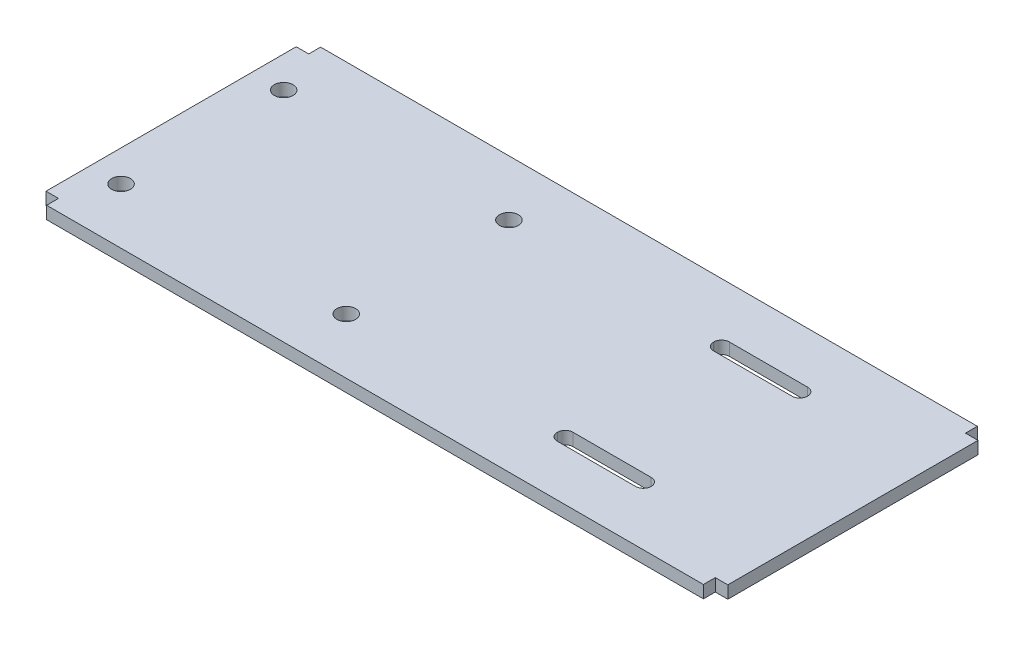
ISO-10303-21;
HEADER;
FILE_DESCRIPTION(('STEP AP214'),'2;1');
FILE_NAME('part.step','',(''),(''),'','','');
FILE_SCHEMA(('AUTOMOTIVE_DESIGN { 1 0 10303 214 1 1 1 1 }'));
ENDSEC;
DATA;
#1=APPLICATION_CONTEXT('core data for automotive mechanical design processes');
#2=APPLICATION_PROTOCOL_DEFINITION('international standard','automotive_design',2000,#1);
#3=PRODUCT_CONTEXT('',#1,'mechanical');
#4=PRODUCT('Part','Part','',(#3));
#5=PRODUCT_RELATED_PRODUCT_CATEGORY('part','',(#4));
#6=PRODUCT_DEFINITION_FORMATION('','',#4);
#7=PRODUCT_DEFINITION_CONTEXT('part definition',#1,'design');
#8=PRODUCT_DEFINITION('design','',#6,#7);
#9=PRODUCT_DEFINITION_SHAPE('','',#8);
#10=(LENGTH_UNIT() NAMED_UNIT(*) SI_UNIT(.MILLI.,.METRE.));
#11=(NAMED_UNIT(*) PLANE_ANGLE_UNIT() SI_UNIT($,.RADIAN.));
#12=(NAMED_UNIT(*) SI_UNIT($,.STERADIAN.) SOLID_ANGLE_UNIT());
#13=UNCERTAINTY_MEASURE_WITH_UNIT(LENGTH_MEASURE(1.E-05),#10,'distance_accuracy_value','');
#14=(GEOMETRIC_REPRESENTATION_CONTEXT(3) GLOBAL_UNCERTAINTY_ASSIGNED_CONTEXT((#13)) GLOBAL_UNIT_ASSIGNED_CONTEXT((#10,
#11,#12)) REPRESENTATION_CONTEXT('',''));
#15=CARTESIAN_POINT('',(0.,0.,0.));
#16=DIRECTION('',(0.,0.,1.));
#17=DIRECTION('',(1.,0.,0.));
#18=AXIS2_PLACEMENT_3D('',#15,#16,#17);
#19=CARTESIAN_POINT('',(66.675,2.54,0.));
#20=DIRECTION('',(1.,0.,0.));
#21=DIRECTION('',(0.,0.,-1.));
#22=AXIS2_PLACEMENT_3D('',#19,#20,#21);
#23=PLANE('',#22);
#24=DIRECTION('',(0.,0.,1.));
#25=VECTOR('',#24,1.);
#26=CARTESIAN_POINT('',(66.675,0.,0.));
#27=LINE('',#26,#25);
#28=CARTESIAN_POINT('',(66.675,0.,25.4));
#29=VERTEX_POINT('',#28);
#30=CARTESIAN_POINT('',(66.675,0.,27.813));
#31=VERTEX_POINT('',#30);
#32=EDGE_CURVE('E378',#29,#31,#27,.T.);
#33=ORIENTED_EDGE('',*,*,#32,.F.);
#34=DIRECTION('',(0.,-1.,0.));
#35=VECTOR('',#34,1.);
#36=CARTESIAN_POINT('',(66.675,2.54,25.4));
#37=LINE('',#36,#35);
#38=CARTESIAN_POINT('',(66.675,2.54,25.4));
#39=VERTEX_POINT('',#38);
#40=EDGE_CURVE('E12',#39,#29,#37,.T.);
#41=ORIENTED_EDGE('',*,*,#40,.F.);
#42=DIRECTION('',(0.,0.,1.));
#43=VECTOR('',#42,1.);
#44=CARTESIAN_POINT('',(66.675,2.54,0.));
#45=LINE('',#44,#43);
#46=CARTESIAN_POINT('',(66.675,2.54,27.813));
#47=VERTEX_POINT('',#46);
#48=EDGE_CURVE('E381',#39,#47,#45,.T.);
#49=ORIENTED_EDGE('',*,*,#48,.T.);
#50=DIRECTION('',(0.,-1.,0.));
#51=VECTOR('',#50,1.);
#52=CARTESIAN_POINT('',(66.675,2.54,27.813));
#53=LINE('',#52,#51);
#54=EDGE_CURVE('E413',#47,#31,#53,.T.);
#55=ORIENTED_EDGE('',*,*,#54,.T.);
#56=EDGE_LOOP('',(#33,#41,#49,#55));
#57=FACE_BOUND('',#56,.T.);
#58=ADVANCED_FACE('F41',(#57),#23,.T.);
#59=CARTESIAN_POINT('',(0.,2.54,25.4));
#60=DIRECTION('',(0.,0.,-1.));
#61=DIRECTION('',(-1.,0.,0.));
#62=AXIS2_PLACEMENT_3D('',#59,#60,#61);
#63=PLANE('',#62);
#64=DIRECTION('',(1.,0.,0.));
#65=VECTOR('',#64,1.);
#66=CARTESIAN_POINT('',(0.,0.,25.4));
#67=LINE('',#66,#65);
#68=CARTESIAN_POINT('',(69.215,0.,25.4));
#69=VERTEX_POINT('',#68);
#70=EDGE_CURVE('E416',#29,#69,#67,.T.);
#71=ORIENTED_EDGE('',*,*,#70,.T.);
#72=DIRECTION('',(0.,-1.,0.));
#73=VECTOR('',#72,1.);
#74=CARTESIAN_POINT('',(69.215,2.54,25.4));
#75=LINE('',#74,#73);
#76=CARTESIAN_POINT('',(69.215,2.54,25.4));
#77=VERTEX_POINT('',#76);
#78=EDGE_CURVE('E48',#77,#69,#75,.T.);
#79=ORIENTED_EDGE('',*,*,#78,.F.);
#80=DIRECTION('',(1.,0.,0.));
#81=VECTOR('',#80,1.);
#82=CARTESIAN_POINT('',(0.,2.54,25.4));
#83=LINE('',#82,#81);
#84=EDGE_CURVE('E384',#39,#77,#83,.T.);
#85=ORIENTED_EDGE('',*,*,#84,.F.);
#86=ORIENTED_EDGE('',*,*,#40,.T.);
#87=EDGE_LOOP('',(#71,#79,#85,#86));
#88=FACE_BOUND('',#87,.T.);
#89=ADVANCED_FACE('F474',(#88),#63,.F.);
#90=CARTESIAN_POINT('',(69.215,2.54,0.));
#91=DIRECTION('',(1.,0.,0.));
#92=DIRECTION('',(0.,0.,-1.));
#93=AXIS2_PLACEMENT_3D('',#90,#91,#92);
#94=PLANE('',#93);
#95=DIRECTION('',(0.,0.,1.));
#96=VECTOR('',#95,1.);
#97=CARTESIAN_POINT('',(69.215,0.,0.));
#98=LINE('',#97,#96);
#99=CARTESIAN_POINT('',(69.215,0.,-25.4));
#100=VERTEX_POINT('',#99);
#101=EDGE_CURVE('E419',#100,#69,#98,.T.);
#102=ORIENTED_EDGE('',*,*,#101,.F.);
#103=DIRECTION('',(0.,-1.,0.));
#104=VECTOR('',#103,1.);
#105=CARTESIAN_POINT('',(69.215,2.54,-25.4));
#106=LINE('',#105,#104);
#107=CARTESIAN_POINT('',(69.215,2.54,-25.4));
#108=VERTEX_POINT('',#107);
#109=EDGE_CURVE('E465',#108,#100,#106,.T.);
#110=ORIENTED_EDGE('',*,*,#109,.F.);
#111=DIRECTION('',(0.,0.,1.));
#112=VECTOR('',#111,1.);
#113=CARTESIAN_POINT('',(69.215,2.54,0.));
#114=LINE('',#113,#112);
#115=EDGE_CURVE('E387',#108,#77,#114,.T.);
#116=ORIENTED_EDGE('',*,*,#115,.T.);
#117=ORIENTED_EDGE('',*,*,#78,.T.);
#118=EDGE_LOOP('',(#102,#110,#116,#117));
#119=FACE_BOUND('',#118,.T.);
#120=ADVANCED_FACE('F469',(#119),#94,.T.);
#121=CARTESIAN_POINT('',(0.,2.54,-25.4));
#122=DIRECTION('',(0.,0.,-1.));
#123=DIRECTION('',(-1.,0.,0.));
#124=AXIS2_PLACEMENT_3D('',#121,#122,#123);
#125=PLANE('',#124);
#126=DIRECTION('',(1.,0.,0.));
#127=VECTOR('',#126,1.);
#128=CARTESIAN_POINT('',(0.,0.,-25.4));
#129=LINE('',#128,#127);
#130=CARTESIAN_POINT('',(66.675,0.,-25.4));
#131=VERTEX_POINT('',#130);
#132=EDGE_CURVE('E422',#131,#100,#129,.T.);
#133=ORIENTED_EDGE('',*,*,#132,.F.);
#134=DIRECTION('',(0.,-1.,0.));
#135=VECTOR('',#134,1.);
#136=CARTESIAN_POINT('',(66.675,2.54,-25.4));
#137=LINE('',#136,#135);
#138=CARTESIAN_POINT('',(66.675,2.54,-25.4));
#139=VERTEX_POINT('',#138);
#140=EDGE_CURVE('E463',#139,#131,#137,.T.);
#141=ORIENTED_EDGE('',*,*,#140,.F.);
#142=DIRECTION('',(1.,0.,0.));
#143=VECTOR('',#142,1.);
#144=CARTESIAN_POINT('',(0.,2.54,-25.4));
#145=LINE('',#144,#143);
#146=EDGE_CURVE('E390',#139,#108,#145,.T.);
#147=ORIENTED_EDGE('',*,*,#146,.T.);
#148=ORIENTED_EDGE('',*,*,#109,.T.);
#149=EDGE_LOOP('',(#133,#141,#147,#148));
#150=FACE_BOUND('',#149,.T.);
#151=ADVANCED_FACE('F480',(#150),#125,.T.);
#152=CARTESIAN_POINT('',(66.675,2.54,0.));
#153=DIRECTION('',(-1.,0.,0.));
#154=DIRECTION('',(0.,0.,1.));
#155=AXIS2_PLACEMENT_3D('',#152,#153,#154);
#156=PLANE('',#155);
#157=DIRECTION('',(0.,0.,-1.));
#158=VECTOR('',#157,1.);
#159=CARTESIAN_POINT('',(66.675,0.,0.));
#160=LINE('',#159,#158);
#161=CARTESIAN_POINT('',(66.675,0.,-27.813));
#162=VERTEX_POINT('',#161);
#163=EDGE_CURVE('E425',#131,#162,#160,.T.);
#164=ORIENTED_EDGE('',*,*,#163,.T.);
#165=DIRECTION('',(0.,-1.,0.));
#166=VECTOR('',#165,1.);
#167=CARTESIAN_POINT('',(66.675,2.54,-27.813));
#168=LINE('',#167,#166);
#169=CARTESIAN_POINT('',(66.675,2.54,-27.813));
#170=VERTEX_POINT('',#169);
#171=EDGE_CURVE('E461',#170,#162,#168,.T.);
#172=ORIENTED_EDGE('',*,*,#171,.F.);
#173=DIRECTION('',(0.,0.,-1.));
#174=VECTOR('',#173,1.);
#175=CARTESIAN_POINT('',(66.675,2.54,0.));
#176=LINE('',#175,#174);
#177=EDGE_CURVE('E393',#139,#170,#176,.T.);
#178=ORIENTED_EDGE('',*,*,#177,.F.);
#179=ORIENTED_EDGE('',*,*,#140,.T.);
#180=EDGE_LOOP('',(#164,#172,#178,#179));
#181=FACE_BOUND('',#180,.T.);
#182=ADVANCED_FACE('F519',(#181),#156,.F.);
#183=CARTESIAN_POINT('',(0.,2.54,-27.813));
#184=DIRECTION('',(0.,0.,-1.));
#185=DIRECTION('',(-1.,0.,0.));
#186=AXIS2_PLACEMENT_3D('',#183,#184,#185);
#187=PLANE('',#186);
#188=DIRECTION('',(1.,0.,0.));
#189=VECTOR('',#188,1.);
#190=CARTESIAN_POINT('',(0.,0.,-27.813));
#191=LINE('',#190,#189);
#192=CARTESIAN_POINT('',(-66.675,0.,-27.813));
#193=VERTEX_POINT('',#192);
#194=EDGE_CURVE('E428',#193,#162,#191,.T.);
#195=ORIENTED_EDGE('',*,*,#194,.F.);
#196=DIRECTION('',(0.,-1.,0.));
#197=VECTOR('',#196,1.);
#198=CARTESIAN_POINT('',(-66.675,2.54,-27.813));
#199=LINE('',#198,#197);
#200=CARTESIAN_POINT('',(-66.675,2.54,-27.813));
#201=VERTEX_POINT('',#200);
#202=EDGE_CURVE('E459',#201,#193,#199,.T.);
#203=ORIENTED_EDGE('',*,*,#202,.F.);
#204=DIRECTION('',(1.,0.,0.));
#205=VECTOR('',#204,1.);
#206=CARTESIAN_POINT('',(0.,2.54,-27.813));
#207=LINE('',#206,#205);
#208=EDGE_CURVE('E395',#201,#170,#207,.T.);
#209=ORIENTED_EDGE('',*,*,#208,.T.);
#210=ORIENTED_EDGE('',*,*,#171,.T.);
#211=EDGE_LOOP('',(#195,#203,#209,#210));
#212=FACE_BOUND('',#211,.T.);
#213=ADVANCED_FACE('F515',(#212),#187,.T.);
#214=CARTESIAN_POINT('',(-66.675,2.54,0.));
#215=DIRECTION('',(-1.,0.,0.));
#216=DIRECTION('',(0.,0.,1.));
#217=AXIS2_PLACEMENT_3D('',#214,#215,#216);
#218=PLANE('',#217);
#219=DIRECTION('',(0.,0.,-1.));
#220=VECTOR('',#219,1.);
#221=CARTESIAN_POINT('',(-66.675,0.,0.));
#222=LINE('',#221,#220);
#223=CARTESIAN_POINT('',(-66.675,0.,-25.4));
#224=VERTEX_POINT('',#223);
#225=EDGE_CURVE('E431',#224,#193,#222,.T.);
#226=ORIENTED_EDGE('',*,*,#225,.F.);
#227=DIRECTION('',(0.,-1.,0.));
#228=VECTOR('',#227,1.);
#229=CARTESIAN_POINT('',(-66.675,2.54,-25.4));
#230=LINE('',#229,#228);
#231=CARTESIAN_POINT('',(-66.675,2.54,-25.4));
#232=VERTEX_POINT('',#231);
#233=EDGE_CURVE('E457',#232,#224,#230,.T.);
#234=ORIENTED_EDGE('',*,*,#233,.F.);
#235=DIRECTION('',(0.,0.,-1.));
#236=VECTOR('',#235,1.);
#237=CARTESIAN_POINT('',(-66.675,2.54,0.));
#238=LINE('',#237,#236);
#239=EDGE_CURVE('E398',#232,#201,#238,.T.);
#240=ORIENTED_EDGE('',*,*,#239,.T.);
#241=ORIENTED_EDGE('',*,*,#202,.T.);
#242=EDGE_LOOP('',(#226,#234,#240,#241));
#243=FACE_BOUND('',#242,.T.);
#244=ADVANCED_FACE('F512',(#243),#218,.T.);
#245=CARTESIAN_POINT('',(0.,2.54,-25.4));
#246=DIRECTION('',(0.,0.,1.));
#247=DIRECTION('',(1.,0.,0.));
#248=AXIS2_PLACEMENT_3D('',#245,#246,#247);
#249=PLANE('',#248);
#250=DIRECTION('',(-1.,0.,0.));
#251=VECTOR('',#250,1.);
#252=CARTESIAN_POINT('',(0.,0.,-25.4));
#253=LINE('',#252,#251);
#254=CARTESIAN_POINT('',(-69.215,0.,-25.4));
#255=VERTEX_POINT('',#254);
#256=EDGE_CURVE('E434',#224,#255,#253,.T.);
#257=ORIENTED_EDGE('',*,*,#256,.T.);
#258=DIRECTION('',(0.,-1.,0.));
#259=VECTOR('',#258,1.);
#260=CARTESIAN_POINT('',(-69.215,2.54,-25.4));
#261=LINE('',#260,#259);
#262=CARTESIAN_POINT('',(-69.215,2.54,-25.4));
#263=VERTEX_POINT('',#262);
#264=EDGE_CURVE('E454',#263,#255,#261,.T.);
#265=ORIENTED_EDGE('',*,*,#264,.F.);
#266=DIRECTION('',(-1.,0.,0.));
#267=VECTOR('',#266,1.);
#268=CARTESIAN_POINT('',(0.,2.54,-25.4));
#269=LINE('',#268,#267);
#270=EDGE_CURVE('E401',#232,#263,#269,.T.);
#271=ORIENTED_EDGE('',*,*,#270,.F.);
#272=ORIENTED_EDGE('',*,*,#233,.T.);
#273=EDGE_LOOP('',(#257,#265,#271,#272));
#274=FACE_BOUND('',#273,.T.);
#275=ADVANCED_FACE('F509',(#274),#249,.F.);
#276=CARTESIAN_POINT('',(-69.215,2.54,0.));
#277=DIRECTION('',(1.,0.,0.));
#278=DIRECTION('',(0.,0.,-1.));
#279=AXIS2_PLACEMENT_3D('',#276,#277,#278);
#280=PLANE('',#279);
#281=DIRECTION('',(0.,0.,1.));
#282=VECTOR('',#281,1.);
#283=CARTESIAN_POINT('',(-69.215,0.,0.));
#284=LINE('',#283,#282);
#285=CARTESIAN_POINT('',(-69.215,0.,25.4));
#286=VERTEX_POINT('',#285);
#287=EDGE_CURVE('E436',#255,#286,#284,.T.);
#288=ORIENTED_EDGE('',*,*,#287,.T.);
#289=DIRECTION('',(0.,-1.,0.));
#290=VECTOR('',#289,1.);
#291=CARTESIAN_POINT('',(-69.215,2.54,25.4));
#292=LINE('',#291,#290);
#293=CARTESIAN_POINT('',(-69.215,2.54,25.4));
#294=VERTEX_POINT('',#293);
#295=EDGE_CURVE('E452',#294,#286,#292,.T.);
#296=ORIENTED_EDGE('',*,*,#295,.F.);
#297=DIRECTION('',(0.,0.,1.));
#298=VECTOR('',#297,1.);
#299=CARTESIAN_POINT('',(-69.215,2.54,0.));
#300=LINE('',#299,#298);
#301=EDGE_CURVE('E403',#263,#294,#300,.T.);
#302=ORIENTED_EDGE('',*,*,#301,.F.);
#303=ORIENTED_EDGE('',*,*,#264,.T.);
#304=EDGE_LOOP('',(#288,#296,#302,#303));
#305=FACE_BOUND('',#304,.T.);
#306=ADVANCED_FACE('F504',(#305),#280,.F.);
#307=CARTESIAN_POINT('',(0.,2.54,25.4));
#308=DIRECTION('',(0.,0.,1.));
#309=DIRECTION('',(1.,0.,0.));
#310=AXIS2_PLACEMENT_3D('',#307,#308,#309);
#311=PLANE('',#310);
#312=DIRECTION('',(-1.,0.,0.));
#313=VECTOR('',#312,1.);
#314=CARTESIAN_POINT('',(0.,0.,25.4));
#315=LINE('',#314,#313);
#316=CARTESIAN_POINT('',(-66.675,0.,25.4));
#317=VERTEX_POINT('',#316);
#318=EDGE_CURVE('E439',#317,#286,#315,.T.);
#319=ORIENTED_EDGE('',*,*,#318,.F.);
#320=DIRECTION('',(0.,-1.,0.));
#321=VECTOR('',#320,1.);
#322=CARTESIAN_POINT('',(-66.675,2.54,25.4));
#323=LINE('',#322,#321);
#324=CARTESIAN_POINT('',(-66.675,2.54,25.4));
#325=VERTEX_POINT('',#324);
#326=EDGE_CURVE('E450',#325,#317,#323,.T.);
#327=ORIENTED_EDGE('',*,*,#326,.F.);
#328=DIRECTION('',(-1.,0.,0.));
#329=VECTOR('',#328,1.);
#330=CARTESIAN_POINT('',(0.,2.54,25.4));
#331=LINE('',#330,#329);
#332=EDGE_CURVE('E405',#325,#294,#331,.T.);
#333=ORIENTED_EDGE('',*,*,#332,.T.);
#334=ORIENTED_EDGE('',*,*,#295,.T.);
#335=EDGE_LOOP('',(#319,#327,#333,#334));
#336=FACE_BOUND('',#335,.T.);
#337=ADVANCED_FACE('F498',(#336),#311,.T.);
#338=CARTESIAN_POINT('',(-66.675,2.54,0.));
#339=DIRECTION('',(-1.,0.,0.));
#340=DIRECTION('',(0.,0.,1.));
#341=AXIS2_PLACEMENT_3D('',#338,#339,#340);
#342=PLANE('',#341);
#343=DIRECTION('',(0.,0.,-1.));
#344=VECTOR('',#343,1.);
#345=CARTESIAN_POINT('',(-66.675,0.,0.));
#346=LINE('',#345,#344);
#347=CARTESIAN_POINT('',(-66.675,0.,27.813));
#348=VERTEX_POINT('',#347);
#349=EDGE_CURVE('E442',#348,#317,#346,.T.);
#350=ORIENTED_EDGE('',*,*,#349,.F.);
#351=DIRECTION('',(0.,-1.,0.));
#352=VECTOR('',#351,1.);
#353=CARTESIAN_POINT('',(-66.675,2.54,27.813));
#354=LINE('',#353,#352);
#355=CARTESIAN_POINT('',(-66.675,2.54,27.813));
#356=VERTEX_POINT('',#355);
#357=EDGE_CURVE('E448',#356,#348,#354,.T.);
#358=ORIENTED_EDGE('',*,*,#357,.F.);
#359=DIRECTION('',(0.,0.,-1.));
#360=VECTOR('',#359,1.);
#361=CARTESIAN_POINT('',(-66.675,2.54,0.));
#362=LINE('',#361,#360);
#363=EDGE_CURVE('E408',#356,#325,#362,.T.);
#364=ORIENTED_EDGE('',*,*,#363,.T.);
#365=ORIENTED_EDGE('',*,*,#326,.T.);
#366=EDGE_LOOP('',(#350,#358,#364,#365));
#367=FACE_BOUND('',#366,.T.);
#368=ADVANCED_FACE('F494',(#367),#342,.T.);
#369=CARTESIAN_POINT('',(0.,2.54,27.813));
#370=DIRECTION('',(0.,0.,-1.));
#371=DIRECTION('',(-1.,0.,0.));
#372=AXIS2_PLACEMENT_3D('',#369,#370,#371);
#373=PLANE('',#372);
#374=DIRECTION('',(1.,0.,0.));
#375=VECTOR('',#374,1.);
#376=CARTESIAN_POINT('',(0.,0.,27.813));
#377=LINE('',#376,#375);
#378=EDGE_CURVE('E385',#348,#31,#377,.T.);
#379=ORIENTED_EDGE('',*,*,#378,.T.);
#380=ORIENTED_EDGE('',*,*,#54,.F.);
#381=DIRECTION('',(1.,0.,0.));
#382=VECTOR('',#381,1.);
#383=CARTESIAN_POINT('',(0.,2.54,27.813));
#384=LINE('',#383,#382);
#385=EDGE_CURVE('E411',#356,#47,#384,.T.);
#386=ORIENTED_EDGE('',*,*,#385,.F.);
#387=ORIENTED_EDGE('',*,*,#357,.T.);
#388=EDGE_LOOP('',(#379,#380,#386,#387));
#389=FACE_BOUND('',#388,.T.);
#390=ADVANCED_FACE('F593',(#389),#373,.F.);
#391=CARTESIAN_POINT('',(0.,2.54,0.));
#392=DIRECTION('',(0.,1.,0.));
#393=DIRECTION('',(0.,0.,1.));
#394=AXIS2_PLACEMENT_3D('',#391,#392,#393);
#395=PLANE('',#394);
#396=CARTESIAN_POINT('',(26.6573,2.54,-15.8623));
#397=DIRECTION('',(0.,1.,0.));
#398=DIRECTION('',(0.,0.,1.));
#399=AXIS2_PLACEMENT_3D('',#396,#397,#398);
#400=CIRCLE('',#399,1.5748);
#401=CARTESIAN_POINT('',(25.0825,2.54,-15.8623));
#402=VERTEX_POINT('',#401);
#403=CARTESIAN_POINT('',(26.6573,2.54,-14.2875));
#404=VERTEX_POINT('',#403);
#405=EDGE_CURVE('E55',#402,#404,#400,.T.);
#406=ORIENTED_EDGE('',*,*,#405,.F.);
#407=DIRECTION('',(0.,0.,1.));
#408=VECTOR('',#407,1.);
#409=CARTESIAN_POINT('',(25.0825,2.54,-15.8877));
#410=LINE('',#409,#408);
#411=CARTESIAN_POINT('',(25.0825,2.54,-15.8877));
#412=VERTEX_POINT('',#411);
#413=EDGE_CURVE('E243',#412,#402,#410,.T.);
#414=ORIENTED_EDGE('',*,*,#413,.F.);
#415=CARTESIAN_POINT('',(26.6573,2.54,-15.8877));
#416=DIRECTION('',(0.,1.,0.));
#417=DIRECTION('',(0.,0.,1.));
#418=AXIS2_PLACEMENT_3D('',#415,#416,#417);
#419=CIRCLE('',#418,1.5748);
#420=CARTESIAN_POINT('',(26.6573,2.54,-17.4625));
#421=VERTEX_POINT('',#420);
#422=EDGE_CURVE('E246',#421,#412,#419,.T.);
#423=ORIENTED_EDGE('',*,*,#422,.F.);
#424=DIRECTION('',(-1.,0.,0.));
#425=VECTOR('',#424,1.);
#426=CARTESIAN_POINT('',(42.5577,2.54,-17.4625));
#427=LINE('',#426,#425);
#428=CARTESIAN_POINT('',(42.5577,2.54,-17.4625));
#429=VERTEX_POINT('',#428);
#430=EDGE_CURVE('E274',#429,#421,#427,.T.);
#431=ORIENTED_EDGE('',*,*,#430,.F.);
#432=CARTESIAN_POINT('',(42.5577,2.54,-15.8877));
#433=DIRECTION('',(0.,1.,0.));
#434=DIRECTION('',(0.,0.,1.));
#435=AXIS2_PLACEMENT_3D('',#432,#433,#434);
#436=CIRCLE('',#435,1.5748);
#437=CARTESIAN_POINT('',(44.1325,2.54,-15.8877));
#438=VERTEX_POINT('',#437);
#439=EDGE_CURVE('E271',#438,#429,#436,.T.);
#440=ORIENTED_EDGE('',*,*,#439,.F.);
#441=DIRECTION('',(0.,0.,-1.));
#442=VECTOR('',#441,1.);
#443=CARTESIAN_POINT('',(44.1325,2.54,-15.8877));
#444=LINE('',#443,#442);
#445=CARTESIAN_POINT('',(44.1325,2.54,-15.8623));
#446=VERTEX_POINT('',#445);
#447=EDGE_CURVE('E268',#446,#438,#444,.T.);
#448=ORIENTED_EDGE('',*,*,#447,.F.);
#449=CARTESIAN_POINT('',(42.5577,2.54,-15.8623));
#450=DIRECTION('',(0.,1.,0.));
#451=DIRECTION('',(0.,0.,1.));
#452=AXIS2_PLACEMENT_3D('',#449,#450,#451);
#453=CIRCLE('',#452,1.5748);
#454=CARTESIAN_POINT('',(42.5577,2.54,-14.2875));
#455=VERTEX_POINT('',#454);
#456=EDGE_CURVE('E265',#455,#446,#453,.T.);
#457=ORIENTED_EDGE('',*,*,#456,.F.);
#458=DIRECTION('',(1.,0.,0.));
#459=VECTOR('',#458,1.);
#460=CARTESIAN_POINT('',(42.5577,2.54,-14.2875));
#461=LINE('',#460,#459);
#462=EDGE_CURVE('E263',#404,#455,#461,.T.);
#463=ORIENTED_EDGE('',*,*,#462,.F.);
#464=EDGE_LOOP('',(#406,#414,#423,#431,#440,#448,#457,#463));
#465=FACE_BOUND('',#464,.T.);
#466=CARTESIAN_POINT('',(26.6573,2.54,15.8877));
#467=DIRECTION('',(0.,1.,0.));
#468=DIRECTION('',(0.,0.,-1.));
#469=AXIS2_PLACEMENT_3D('',#466,#467,#468);
#470=CIRCLE('',#469,1.5748);
#471=CARTESIAN_POINT('',(25.0825,2.54,15.8877));
#472=VERTEX_POINT('',#471);
#473=CARTESIAN_POINT('',(26.6573,2.54,17.4625));
#474=VERTEX_POINT('',#473);
#475=EDGE_CURVE('E281',#472,#474,#470,.T.);
#476=ORIENTED_EDGE('',*,*,#475,.F.);
#477=DIRECTION('',(0.,0.,1.));
#478=VECTOR('',#477,1.);
#479=CARTESIAN_POINT('',(25.0825,2.54,15.8877));
#480=LINE('',#479,#478);
#481=CARTESIAN_POINT('',(25.0825,2.54,15.8623));
#482=VERTEX_POINT('',#481);
#483=EDGE_CURVE('E297',#482,#472,#480,.T.);
#484=ORIENTED_EDGE('',*,*,#483,.F.);
#485=CARTESIAN_POINT('',(26.6573,2.54,15.8623));
#486=DIRECTION('',(0.,1.,0.));
#487=DIRECTION('',(0.,0.,1.));
#488=AXIS2_PLACEMENT_3D('',#485,#486,#487);
#489=CIRCLE('',#488,1.5748);
#490=CARTESIAN_POINT('',(26.6573,2.54,14.2875));
#491=VERTEX_POINT('',#490);
#492=EDGE_CURVE('E335',#491,#482,#489,.T.);
#493=ORIENTED_EDGE('',*,*,#492,.F.);
#494=DIRECTION('',(-1.,0.,0.));
#495=VECTOR('',#494,1.);
#496=CARTESIAN_POINT('',(42.5577,2.54,14.2875));
#497=LINE('',#496,#495);
#498=CARTESIAN_POINT('',(42.5577,2.54,14.2875));
#499=VERTEX_POINT('',#498);
#500=EDGE_CURVE('E332',#499,#491,#497,.T.);
#501=ORIENTED_EDGE('',*,*,#500,.F.);
#502=CARTESIAN_POINT('',(42.5577,2.54,15.8623));
#503=DIRECTION('',(0.,1.,0.));
#504=DIRECTION('',(0.,0.,1.));
#505=AXIS2_PLACEMENT_3D('',#502,#503,#504);
#506=CIRCLE('',#505,1.5748);
#507=CARTESIAN_POINT('',(44.1325,2.54,15.8623));
#508=VERTEX_POINT('',#507);
#509=EDGE_CURVE('E329',#508,#499,#506,.T.);
#510=ORIENTED_EDGE('',*,*,#509,.F.);
#511=DIRECTION('',(0.,0.,-1.));
#512=VECTOR('',#511,1.);
#513=CARTESIAN_POINT('',(44.1325,2.54,15.8877));
#514=LINE('',#513,#512);
#515=CARTESIAN_POINT('',(44.1325,2.54,15.8877));
#516=VERTEX_POINT('',#515);
#517=EDGE_CURVE('E326',#516,#508,#514,.T.);
#518=ORIENTED_EDGE('',*,*,#517,.F.);
#519=CARTESIAN_POINT('',(42.5577,2.54,15.8877));
#520=DIRECTION('',(0.,1.,0.));
#521=DIRECTION('',(0.,0.,-1.));
#522=AXIS2_PLACEMENT_3D('',#519,#520,#521);
#523=CIRCLE('',#522,1.5748);
#524=CARTESIAN_POINT('',(42.5577,2.54,17.4625));
#525=VERTEX_POINT('',#524);
#526=EDGE_CURVE('E323',#525,#516,#523,.T.);
#527=ORIENTED_EDGE('',*,*,#526,.F.);
#528=DIRECTION('',(1.,0.,0.));
#529=VECTOR('',#528,1.);
#530=CARTESIAN_POINT('',(42.5577,2.54,17.4625));
#531=LINE('',#530,#529);
#532=EDGE_CURVE('E320',#474,#525,#531,.T.);
#533=ORIENTED_EDGE('',*,*,#532,.F.);
#534=EDGE_LOOP('',(#476,#484,#493,#501,#510,#518,#527,#533));
#535=FACE_BOUND('',#534,.T.);
#536=CARTESIAN_POINT('',(-62.865,2.54,16.51));
#537=DIRECTION('',(0.,1.,0.));
#538=DIRECTION('',(0.,0.,1.));
#539=AXIS2_PLACEMENT_3D('',#536,#537,#538);
#540=CIRCLE('',#539,1.905);
#541=CARTESIAN_POINT('',(-62.865,2.54,18.415));
#542=VERTEX_POINT('',#541);
#543=EDGE_CURVE('E357',#542,#542,#540,.T.);
#544=ORIENTED_EDGE('',*,*,#543,.F.);
#545=EDGE_LOOP('',(#544));
#546=FACE_BOUND('',#545,.T.);
#547=CARTESIAN_POINT('',(-17.145,2.54,16.51));
#548=DIRECTION('',(0.,1.,0.));
#549=DIRECTION('',(0.,0.,1.));
#550=AXIS2_PLACEMENT_3D('',#547,#548,#549);
#551=CIRCLE('',#550,1.905);
#552=CARTESIAN_POINT('',(-17.145,2.54,18.415));
#553=VERTEX_POINT('',#552);
#554=EDGE_CURVE('E363',#553,#553,#551,.T.);
#555=ORIENTED_EDGE('',*,*,#554,.F.);
#556=EDGE_LOOP('',(#555));
#557=FACE_BOUND('',#556,.T.);
#558=CARTESIAN_POINT('',(-17.145,2.54,-16.51));
#559=DIRECTION('',(0.,1.,0.));
#560=DIRECTION('',(0.,0.,1.));
#561=AXIS2_PLACEMENT_3D('',#558,#559,#560);
#562=CIRCLE('',#561,1.905);
#563=CARTESIAN_POINT('',(-17.145,2.54,-14.605));
#564=VERTEX_POINT('',#563);
#565=EDGE_CURVE('E369',#564,#564,#562,.T.);
#566=ORIENTED_EDGE('',*,*,#565,.F.);
#567=EDGE_LOOP('',(#566));
#568=FACE_BOUND('',#567,.T.);
#569=CARTESIAN_POINT('',(-62.865,2.54,-16.51));
#570=DIRECTION('',(0.,1.,0.));
#571=DIRECTION('',(0.,0.,1.));
#572=AXIS2_PLACEMENT_3D('',#569,#570,#571);
#573=CIRCLE('',#572,1.905);
#574=CARTESIAN_POINT('',(-62.865,2.54,-14.605));
#575=VERTEX_POINT('',#574);
#576=EDGE_CURVE('E372',#575,#575,#573,.T.);
#577=ORIENTED_EDGE('',*,*,#576,.F.);
#578=EDGE_LOOP('',(#577));
#579=FACE_BOUND('',#578,.T.);
#580=ORIENTED_EDGE('',*,*,#48,.F.);
#581=ORIENTED_EDGE('',*,*,#84,.T.);
#582=ORIENTED_EDGE('',*,*,#115,.F.);
#583=ORIENTED_EDGE('',*,*,#146,.F.);
#584=ORIENTED_EDGE('',*,*,#177,.T.);
#585=ORIENTED_EDGE('',*,*,#208,.F.);
#586=ORIENTED_EDGE('',*,*,#239,.F.);
#587=ORIENTED_EDGE('',*,*,#270,.T.);
#588=ORIENTED_EDGE('',*,*,#301,.T.);
#589=ORIENTED_EDGE('',*,*,#332,.F.);
#590=ORIENTED_EDGE('',*,*,#363,.F.);
#591=ORIENTED_EDGE('',*,*,#385,.T.);
#592=EDGE_LOOP('',(#580,#581,#582,#583,#584,#585,#586,#587,#588,#589,#590,#591));
#593=FACE_BOUND('',#592,.T.);
#594=ADVANCED_FACE('F485',(#465,#535,#546,#557,#568,#579,#593),#395,.T.);
#595=CARTESIAN_POINT('',(0.,0.,0.));
#596=DIRECTION('',(0.,1.,0.));
#597=DIRECTION('',(0.,0.,1.));
#598=AXIS2_PLACEMENT_3D('',#595,#596,#597);
#599=PLANE('',#598);
#600=DIRECTION('',(0.,0.,1.));
#601=VECTOR('',#600,1.);
#602=CARTESIAN_POINT('',(25.0825,0.,-15.8877));
#603=LINE('',#602,#601);
#604=CARTESIAN_POINT('',(25.0825,0.,-15.8877));
#605=VERTEX_POINT('',#604);
#606=CARTESIAN_POINT('',(25.0825,0.,-15.8623));
#607=VERTEX_POINT('',#606);
#608=EDGE_CURVE('E232',#605,#607,#603,.T.);
#609=ORIENTED_EDGE('',*,*,#608,.T.);
#610=CARTESIAN_POINT('',(26.6573,0.,-15.8623));
#611=DIRECTION('',(0.,1.,0.));
#612=DIRECTION('',(0.,0.,1.));
#613=AXIS2_PLACEMENT_3D('',#610,#611,#612);
#614=CIRCLE('',#613,1.5748);
#615=CARTESIAN_POINT('',(26.6573,0.,-14.2875));
#616=VERTEX_POINT('',#615);
#617=EDGE_CURVE('E226',#607,#616,#614,.T.);
#618=ORIENTED_EDGE('',*,*,#617,.T.);
#619=DIRECTION('',(1.,0.,0.));
#620=VECTOR('',#619,1.);
#621=CARTESIAN_POINT('',(42.5577,0.,-14.2875));
#622=LINE('',#621,#620);
#623=CARTESIAN_POINT('',(42.5577,0.,-14.2875));
#624=VERTEX_POINT('',#623);
#625=EDGE_CURVE('E235',#616,#624,#622,.T.);
#626=ORIENTED_EDGE('',*,*,#625,.T.);
#627=CARTESIAN_POINT('',(42.5577,0.,-15.8623));
#628=DIRECTION('',(0.,1.,0.));
#629=DIRECTION('',(0.,0.,1.));
#630=AXIS2_PLACEMENT_3D('',#627,#628,#629);
#631=CIRCLE('',#630,1.5748);
#632=CARTESIAN_POINT('',(44.1325,0.,-15.8623));
#633=VERTEX_POINT('',#632);
#634=EDGE_CURVE('E63',#624,#633,#631,.T.);
#635=ORIENTED_EDGE('',*,*,#634,.T.);
#636=DIRECTION('',(0.,0.,-1.));
#637=VECTOR('',#636,1.);
#638=CARTESIAN_POINT('',(44.1325,0.,-15.8877));
#639=LINE('',#638,#637);
#640=CARTESIAN_POINT('',(44.1325,0.,-15.8877));
#641=VERTEX_POINT('',#640);
#642=EDGE_CURVE('E250',#633,#641,#639,.T.);
#643=ORIENTED_EDGE('',*,*,#642,.T.);
#644=CARTESIAN_POINT('',(42.5577,0.,-15.8877));
#645=DIRECTION('',(0.,1.,0.));
#646=DIRECTION('',(0.,0.,1.));
#647=AXIS2_PLACEMENT_3D('',#644,#645,#646);
#648=CIRCLE('',#647,1.5748);
#649=CARTESIAN_POINT('',(42.5577,0.,-17.4625));
#650=VERTEX_POINT('',#649);
#651=EDGE_CURVE('E253',#641,#650,#648,.T.);
#652=ORIENTED_EDGE('',*,*,#651,.T.);
#653=DIRECTION('',(-1.,0.,0.));
#654=VECTOR('',#653,1.);
#655=CARTESIAN_POINT('',(42.5577,0.,-17.4625));
#656=LINE('',#655,#654);
#657=CARTESIAN_POINT('',(26.6573,0.,-17.4625));
#658=VERTEX_POINT('',#657);
#659=EDGE_CURVE('E256',#650,#658,#656,.T.);
#660=ORIENTED_EDGE('',*,*,#659,.T.);
#661=CARTESIAN_POINT('',(26.6573,0.,-15.8877));
#662=DIRECTION('',(0.,1.,0.));
#663=DIRECTION('',(0.,0.,1.));
#664=AXIS2_PLACEMENT_3D('',#661,#662,#663);
#665=CIRCLE('',#664,1.5748);
#666=EDGE_CURVE('E259',#658,#605,#665,.T.);
#667=ORIENTED_EDGE('',*,*,#666,.T.);
#668=EDGE_LOOP('',(#609,#618,#626,#635,#643,#652,#660,#667));
#669=FACE_BOUND('',#668,.T.);
#670=DIRECTION('',(0.,0.,1.));
#671=VECTOR('',#670,1.);
#672=CARTESIAN_POINT('',(25.0825,0.,15.8877));
#673=LINE('',#672,#671);
#674=CARTESIAN_POINT('',(25.0825,0.,15.8623));
#675=VERTEX_POINT('',#674);
#676=CARTESIAN_POINT('',(25.0825,0.,15.8877));
#677=VERTEX_POINT('',#676);
#678=EDGE_CURVE('E315',#675,#677,#673,.T.);
#679=ORIENTED_EDGE('',*,*,#678,.T.);
#680=CARTESIAN_POINT('',(26.6573,0.,15.8877));
#681=DIRECTION('',(0.,1.,0.));
#682=DIRECTION('',(0.,0.,-1.));
#683=AXIS2_PLACEMENT_3D('',#680,#681,#682);
#684=CIRCLE('',#683,1.5748);
#685=CARTESIAN_POINT('',(26.6573,0.,17.4625));
#686=VERTEX_POINT('',#685);
#687=EDGE_CURVE('E293',#677,#686,#684,.T.);
#688=ORIENTED_EDGE('',*,*,#687,.T.);
#689=DIRECTION('',(1.,0.,0.));
#690=VECTOR('',#689,1.);
#691=CARTESIAN_POINT('',(42.5577,0.,17.4625));
#692=LINE('',#691,#690);
#693=CARTESIAN_POINT('',(42.5577,0.,17.4625));
#694=VERTEX_POINT('',#693);
#695=EDGE_CURVE('E296',#686,#694,#692,.T.);
#696=ORIENTED_EDGE('',*,*,#695,.T.);
#697=CARTESIAN_POINT('',(42.5577,0.,15.8877));
#698=DIRECTION('',(0.,1.,0.));
#699=DIRECTION('',(0.,0.,-1.));
#700=AXIS2_PLACEMENT_3D('',#697,#698,#699);
#701=CIRCLE('',#700,1.5748);
#702=CARTESIAN_POINT('',(44.1325,0.,15.8877));
#703=VERTEX_POINT('',#702);
#704=EDGE_CURVE('E300',#694,#703,#701,.T.);
#705=ORIENTED_EDGE('',*,*,#704,.T.);
#706=DIRECTION('',(0.,0.,-1.));
#707=VECTOR('',#706,1.);
#708=CARTESIAN_POINT('',(44.1325,0.,15.8877));
#709=LINE('',#708,#707);
#710=CARTESIAN_POINT('',(44.1325,0.,15.8623));
#711=VERTEX_POINT('',#710);
#712=EDGE_CURVE('E303',#703,#711,#709,.T.);
#713=ORIENTED_EDGE('',*,*,#712,.T.);
#714=CARTESIAN_POINT('',(42.5577,0.,15.8623));
#715=DIRECTION('',(0.,1.,0.));
#716=DIRECTION('',(0.,0.,1.));
#717=AXIS2_PLACEMENT_3D('',#714,#715,#716);
#718=CIRCLE('',#717,1.5748);
#719=CARTESIAN_POINT('',(42.5577,0.,14.2875));
#720=VERTEX_POINT('',#719);
#721=EDGE_CURVE('E306',#711,#720,#718,.T.);
#722=ORIENTED_EDGE('',*,*,#721,.T.);
#723=DIRECTION('',(-1.,0.,0.));
#724=VECTOR('',#723,1.);
#725=CARTESIAN_POINT('',(42.5577,0.,14.2875));
#726=LINE('',#725,#724);
#727=CARTESIAN_POINT('',(26.6573,0.,14.2875));
#728=VERTEX_POINT('',#727);
#729=EDGE_CURVE('E309',#720,#728,#726,.T.);
#730=ORIENTED_EDGE('',*,*,#729,.T.);
#731=CARTESIAN_POINT('',(26.6573,0.,15.8623));
#732=DIRECTION('',(0.,1.,0.));
#733=DIRECTION('',(0.,0.,1.));
#734=AXIS2_PLACEMENT_3D('',#731,#732,#733);
#735=CIRCLE('',#734,1.5748);
#736=EDGE_CURVE('E312',#728,#675,#735,.T.);
#737=ORIENTED_EDGE('',*,*,#736,.T.);
#738=EDGE_LOOP('',(#679,#688,#696,#705,#713,#722,#730,#737));
#739=FACE_BOUND('',#738,.T.);
#740=CARTESIAN_POINT('',(-62.865,0.,16.51));
#741=DIRECTION('',(0.,1.,0.));
#742=DIRECTION('',(0.,0.,1.));
#743=AXIS2_PLACEMENT_3D('',#740,#741,#742);
#744=CIRCLE('',#743,1.905);
#745=CARTESIAN_POINT('',(-62.865,0.,18.415));
#746=VERTEX_POINT('',#745);
#747=EDGE_CURVE('E342',#746,#746,#744,.T.);
#748=ORIENTED_EDGE('',*,*,#747,.T.);
#749=EDGE_LOOP('',(#748));
#750=FACE_BOUND('',#749,.T.);
#751=CARTESIAN_POINT('',(-17.145,0.,16.51));
#752=DIRECTION('',(0.,1.,0.));
#753=DIRECTION('',(0.,0.,1.));
#754=AXIS2_PLACEMENT_3D('',#751,#752,#753);
#755=CIRCLE('',#754,1.905);
#756=CARTESIAN_POINT('',(-17.145,0.,18.415));
#757=VERTEX_POINT('',#756);
#758=EDGE_CURVE('E360',#757,#757,#755,.T.);
#759=ORIENTED_EDGE('',*,*,#758,.T.);
#760=EDGE_LOOP('',(#759));
#761=FACE_BOUND('',#760,.T.);
#762=CARTESIAN_POINT('',(-17.145,0.,-16.51));
#763=DIRECTION('',(0.,1.,0.));
#764=DIRECTION('',(0.,0.,1.));
#765=AXIS2_PLACEMENT_3D('',#762,#763,#764);
#766=CIRCLE('',#765,1.905);
#767=CARTESIAN_POINT('',(-17.145,0.,-14.605));
#768=VERTEX_POINT('',#767);
#769=EDGE_CURVE('E366',#768,#768,#766,.T.);
#770=ORIENTED_EDGE('',*,*,#769,.T.);
#771=EDGE_LOOP('',(#770));
#772=FACE_BOUND('',#771,.T.);
#773=CARTESIAN_POINT('',(-62.865,0.,-16.51));
#774=DIRECTION('',(0.,1.,0.));
#775=DIRECTION('',(0.,0.,1.));
#776=AXIS2_PLACEMENT_3D('',#773,#774,#775);
#777=CIRCLE('',#776,1.905);
#778=CARTESIAN_POINT('',(-62.865,0.,-14.605));
#779=VERTEX_POINT('',#778);
#780=EDGE_CURVE('E375',#779,#779,#777,.T.);
#781=ORIENTED_EDGE('',*,*,#780,.T.);
#782=EDGE_LOOP('',(#781));
#783=FACE_BOUND('',#782,.T.);
#784=ORIENTED_EDGE('',*,*,#32,.T.);
#785=ORIENTED_EDGE('',*,*,#378,.F.);
#786=ORIENTED_EDGE('',*,*,#349,.T.);
#787=ORIENTED_EDGE('',*,*,#318,.T.);
#788=ORIENTED_EDGE('',*,*,#287,.F.);
#789=ORIENTED_EDGE('',*,*,#256,.F.);
#790=ORIENTED_EDGE('',*,*,#225,.T.);
#791=ORIENTED_EDGE('',*,*,#194,.T.);
#792=ORIENTED_EDGE('',*,*,#163,.F.);
#793=ORIENTED_EDGE('',*,*,#132,.T.);
#794=ORIENTED_EDGE('',*,*,#101,.T.);
#795=ORIENTED_EDGE('',*,*,#70,.F.);
#796=EDGE_LOOP('',(#784,#785,#786,#787,#788,#789,#790,#791,#792,#793,#794,#795));
#797=FACE_BOUND('',#796,.T.);
#798=ADVANCED_FACE('F239',(#669,#739,#750,#761,#772,#783,#797),#599,.F.);
#799=CARTESIAN_POINT('',(-62.865,0.,-16.51));
#800=DIRECTION('',(0.,1.,0.));
#801=DIRECTION('',(0.,0.,1.));
#802=AXIS2_PLACEMENT_3D('',#799,#800,#801);
#803=CYLINDRICAL_SURFACE('',#802,1.905);
#804=ORIENTED_EDGE('',*,*,#780,.F.);
#805=EDGE_LOOP('',(#804));
#806=FACE_BOUND('',#805,.T.);
#807=ORIENTED_EDGE('',*,*,#576,.T.);
#808=EDGE_LOOP('',(#807));
#809=FACE_BOUND('',#808,.T.);
#810=ADVANCED_FACE('F608',(#806,#809),#803,.F.);
#811=CARTESIAN_POINT('',(-17.145,0.,-16.51));
#812=DIRECTION('',(0.,1.,0.));
#813=DIRECTION('',(0.,0.,1.));
#814=AXIS2_PLACEMENT_3D('',#811,#812,#813);
#815=CYLINDRICAL_SURFACE('',#814,1.905);
#816=ORIENTED_EDGE('',*,*,#769,.F.);
#817=EDGE_LOOP('',(#816));
#818=FACE_BOUND('',#817,.T.);
#819=ORIENTED_EDGE('',*,*,#565,.T.);
#820=EDGE_LOOP('',(#819));
#821=FACE_BOUND('',#820,.T.);
#822=ADVANCED_FACE('F613',(#818,#821),#815,.F.);
#823=CARTESIAN_POINT('',(-17.145,0.,16.51));
#824=DIRECTION('',(0.,1.,0.));
#825=DIRECTION('',(0.,0.,1.));
#826=AXIS2_PLACEMENT_3D('',#823,#824,#825);
#827=CYLINDRICAL_SURFACE('',#826,1.905);
#828=ORIENTED_EDGE('',*,*,#758,.F.);
#829=EDGE_LOOP('',(#828));
#830=FACE_BOUND('',#829,.T.);
#831=ORIENTED_EDGE('',*,*,#554,.T.);
#832=EDGE_LOOP('',(#831));
#833=FACE_BOUND('',#832,.T.);
#834=ADVANCED_FACE('F626',(#830,#833),#827,.F.);
#835=CARTESIAN_POINT('',(-62.865,0.,16.51));
#836=DIRECTION('',(0.,1.,0.));
#837=DIRECTION('',(0.,0.,1.));
#838=AXIS2_PLACEMENT_3D('',#835,#836,#837);
#839=CYLINDRICAL_SURFACE('',#838,1.905);
#840=ORIENTED_EDGE('',*,*,#747,.F.);
#841=EDGE_LOOP('',(#840));
#842=FACE_BOUND('',#841,.T.);
#843=ORIENTED_EDGE('',*,*,#543,.T.);
#844=EDGE_LOOP('',(#843));
#845=FACE_BOUND('',#844,.T.);
#846=ADVANCED_FACE('F636',(#842,#845),#839,.F.);
#847=CARTESIAN_POINT('',(26.6573,0.,15.8877));
#848=DIRECTION('',(0.,1.,0.));
#849=DIRECTION('',(0.,0.,1.));
#850=AXIS2_PLACEMENT_3D('',#847,#848,#849);
#851=CYLINDRICAL_SURFACE('',#850,1.5748);
#852=ORIENTED_EDGE('',*,*,#475,.T.);
#853=DIRECTION('',(0.,1.,0.));
#854=VECTOR('',#853,1.);
#855=CARTESIAN_POINT('',(26.6573,0.,17.4625));
#856=LINE('',#855,#854);
#857=EDGE_CURVE('E318',#686,#474,#856,.T.);
#858=ORIENTED_EDGE('',*,*,#857,.F.);
#859=ORIENTED_EDGE('',*,*,#687,.F.);
#860=DIRECTION('',(0.,1.,0.));
#861=VECTOR('',#860,1.);
#862=CARTESIAN_POINT('',(25.0825,0.,15.8877));
#863=LINE('',#862,#861);
#864=EDGE_CURVE('E340',#677,#472,#863,.T.);
#865=ORIENTED_EDGE('',*,*,#864,.T.);
#866=EDGE_LOOP('',(#852,#858,#859,#865));
#867=FACE_BOUND('',#866,.T.);
#868=ADVANCED_FACE('F646',(#867),#851,.F.);
#869=CARTESIAN_POINT('',(25.0825,0.,15.8877));
#870=DIRECTION('',(-1.,0.,0.));
#871=DIRECTION('',(0.,0.,1.));
#872=AXIS2_PLACEMENT_3D('',#869,#870,#871);
#873=PLANE('',#872);
#874=ORIENTED_EDGE('',*,*,#483,.T.);
#875=ORIENTED_EDGE('',*,*,#864,.F.);
#876=ORIENTED_EDGE('',*,*,#678,.F.);
#877=DIRECTION('',(0.,1.,0.));
#878=VECTOR('',#877,1.);
#879=CARTESIAN_POINT('',(25.0825,0.,15.8623));
#880=LINE('',#879,#878);
#881=EDGE_CURVE('E343',#675,#482,#880,.T.);
#882=ORIENTED_EDGE('',*,*,#881,.T.);
#883=EDGE_LOOP('',(#874,#875,#876,#882));
#884=FACE_BOUND('',#883,.T.);
#885=ADVANCED_FACE('F665',(#884),#873,.F.);
#886=CARTESIAN_POINT('',(26.6573,0.,15.8623));
#887=DIRECTION('',(0.,1.,0.));
#888=DIRECTION('',(0.,0.,1.));
#889=AXIS2_PLACEMENT_3D('',#886,#887,#888);
#890=CYLINDRICAL_SURFACE('',#889,1.5748);
#891=ORIENTED_EDGE('',*,*,#492,.T.);
#892=ORIENTED_EDGE('',*,*,#881,.F.);
#893=ORIENTED_EDGE('',*,*,#736,.F.);
#894=DIRECTION('',(0.,1.,0.));
#895=VECTOR('',#894,1.);
#896=CARTESIAN_POINT('',(26.6573,0.,14.2875));
#897=LINE('',#896,#895);
#898=EDGE_CURVE('E345',#728,#491,#897,.T.);
#899=ORIENTED_EDGE('',*,*,#898,.T.);
#900=EDGE_LOOP('',(#891,#892,#893,#899));
#901=FACE_BOUND('',#900,.T.);
#902=ADVANCED_FACE('F675',(#901),#890,.F.);
#903=CARTESIAN_POINT('',(42.5577,0.,14.2875));
#904=DIRECTION('',(0.,0.,-1.));
#905=DIRECTION('',(-1.,0.,0.));
#906=AXIS2_PLACEMENT_3D('',#903,#904,#905);
#907=PLANE('',#906);
#908=ORIENTED_EDGE('',*,*,#500,.T.);
#909=ORIENTED_EDGE('',*,*,#898,.F.);
#910=ORIENTED_EDGE('',*,*,#729,.F.);
#911=DIRECTION('',(0.,1.,0.));
#912=VECTOR('',#911,1.);
#913=CARTESIAN_POINT('',(42.5577,0.,14.2875));
#914=LINE('',#913,#912);
#915=EDGE_CURVE('E347',#720,#499,#914,.T.);
#916=ORIENTED_EDGE('',*,*,#915,.T.);
#917=EDGE_LOOP('',(#908,#909,#910,#916));
#918=FACE_BOUND('',#917,.T.);
#919=ADVANCED_FACE('F685',(#918),#907,.F.);
#920=CARTESIAN_POINT('',(42.5577,0.,15.8623));
#921=DIRECTION('',(0.,1.,0.));
#922=DIRECTION('',(0.,0.,1.));
#923=AXIS2_PLACEMENT_3D('',#920,#921,#922);
#924=CYLINDRICAL_SURFACE('',#923,1.5748);
#925=ORIENTED_EDGE('',*,*,#509,.T.);
#926=ORIENTED_EDGE('',*,*,#915,.F.);
#927=ORIENTED_EDGE('',*,*,#721,.F.);
#928=DIRECTION('',(0.,1.,0.));
#929=VECTOR('',#928,1.);
#930=CARTESIAN_POINT('',(44.1325,0.,15.8623));
#931=LINE('',#930,#929);
#932=EDGE_CURVE('E349',#711,#508,#931,.T.);
#933=ORIENTED_EDGE('',*,*,#932,.T.);
#934=EDGE_LOOP('',(#925,#926,#927,#933));
#935=FACE_BOUND('',#934,.T.);
#936=ADVANCED_FACE('F695',(#935),#924,.F.);
#937=CARTESIAN_POINT('',(44.1325,0.,15.8877));
#938=DIRECTION('',(1.,0.,0.));
#939=DIRECTION('',(0.,0.,-1.));
#940=AXIS2_PLACEMENT_3D('',#937,#938,#939);
#941=PLANE('',#940);
#942=ORIENTED_EDGE('',*,*,#517,.T.);
#943=ORIENTED_EDGE('',*,*,#932,.F.);
#944=ORIENTED_EDGE('',*,*,#712,.F.);
#945=DIRECTION('',(0.,1.,0.));
#946=VECTOR('',#945,1.);
#947=CARTESIAN_POINT('',(44.1325,0.,15.8877));
#948=LINE('',#947,#946);
#949=EDGE_CURVE('E351',#703,#516,#948,.T.);
#950=ORIENTED_EDGE('',*,*,#949,.T.);
#951=EDGE_LOOP('',(#942,#943,#944,#950));
#952=FACE_BOUND('',#951,.T.);
#953=ADVANCED_FACE('F705',(#952),#941,.F.);
#954=CARTESIAN_POINT('',(42.5577,0.,15.8877));
#955=DIRECTION('',(0.,1.,0.));
#956=DIRECTION('',(0.,0.,1.));
#957=AXIS2_PLACEMENT_3D('',#954,#955,#956);
#958=CYLINDRICAL_SURFACE('',#957,1.5748);
#959=ORIENTED_EDGE('',*,*,#526,.T.);
#960=ORIENTED_EDGE('',*,*,#949,.F.);
#961=ORIENTED_EDGE('',*,*,#704,.F.);
#962=DIRECTION('',(0.,1.,0.));
#963=VECTOR('',#962,1.);
#964=CARTESIAN_POINT('',(42.5577,0.,17.4625));
#965=LINE('',#964,#963);
#966=EDGE_CURVE('E353',#694,#525,#965,.T.);
#967=ORIENTED_EDGE('',*,*,#966,.T.);
#968=EDGE_LOOP('',(#959,#960,#961,#967));
#969=FACE_BOUND('',#968,.T.);
#970=ADVANCED_FACE('F715',(#969),#958,.F.);
#971=CARTESIAN_POINT('',(42.5577,0.,17.4625));
#972=DIRECTION('',(0.,0.,1.));
#973=DIRECTION('',(1.,0.,0.));
#974=AXIS2_PLACEMENT_3D('',#971,#972,#973);
#975=PLANE('',#974);
#976=ORIENTED_EDGE('',*,*,#532,.T.);
#977=ORIENTED_EDGE('',*,*,#966,.F.);
#978=ORIENTED_EDGE('',*,*,#695,.F.);
#979=ORIENTED_EDGE('',*,*,#857,.T.);
#980=EDGE_LOOP('',(#976,#977,#978,#979));
#981=FACE_BOUND('',#980,.T.);
#982=ADVANCED_FACE('F725',(#981),#975,.F.);
#983=CARTESIAN_POINT('',(26.6573,0.,-15.8623));
#984=DIRECTION('',(0.,1.,0.));
#985=DIRECTION('',(0.,0.,1.));
#986=AXIS2_PLACEMENT_3D('',#983,#984,#985);
#987=CYLINDRICAL_SURFACE('',#986,1.5748);
#988=ORIENTED_EDGE('',*,*,#405,.T.);
#989=DIRECTION('',(0.,1.,0.));
#990=VECTOR('',#989,1.);
#991=CARTESIAN_POINT('',(26.6573,0.,-14.2875));
#992=LINE('',#991,#990);
#993=EDGE_CURVE('E222',#616,#404,#992,.T.);
#994=ORIENTED_EDGE('',*,*,#993,.F.);
#995=ORIENTED_EDGE('',*,*,#617,.F.);
#996=DIRECTION('',(0.,1.,0.));
#997=VECTOR('',#996,1.);
#998=CARTESIAN_POINT('',(25.0825,0.,-15.8623));
#999=LINE('',#998,#997);
#1000=EDGE_CURVE('E279',#607,#402,#999,.T.);
#1001=ORIENTED_EDGE('',*,*,#1000,.T.);
#1002=EDGE_LOOP('',(#988,#994,#995,#1001));
#1003=FACE_BOUND('',#1002,.T.);
#1004=ADVANCED_FACE('F224',(#1003),#987,.F.);
#1005=CARTESIAN_POINT('',(25.0825,0.,-15.8877));
#1006=DIRECTION('',(-1.,0.,0.));
#1007=DIRECTION('',(0.,0.,1.));
#1008=AXIS2_PLACEMENT_3D('',#1005,#1006,#1007);
#1009=PLANE('',#1008);
#1010=ORIENTED_EDGE('',*,*,#413,.T.);
#1011=ORIENTED_EDGE('',*,*,#1000,.F.);
#1012=ORIENTED_EDGE('',*,*,#608,.F.);
#1013=DIRECTION('',(0.,1.,0.));
#1014=VECTOR('',#1013,1.);
#1015=CARTESIAN_POINT('',(25.0825,0.,-15.8877));
#1016=LINE('',#1015,#1014);
#1017=EDGE_CURVE('E282',#605,#412,#1016,.T.);
#1018=ORIENTED_EDGE('',*,*,#1017,.T.);
#1019=EDGE_LOOP('',(#1010,#1011,#1012,#1018));
#1020=FACE_BOUND('',#1019,.T.);
#1021=ADVANCED_FACE('F744',(#1020),#1009,.F.);
#1022=CARTESIAN_POINT('',(26.6573,0.,-15.8877));
#1023=DIRECTION('',(0.,1.,0.));
#1024=DIRECTION('',(0.,0.,1.));
#1025=AXIS2_PLACEMENT_3D('',#1022,#1023,#1024);
#1026=CYLINDRICAL_SURFACE('',#1025,1.5748);
#1027=ORIENTED_EDGE('',*,*,#422,.T.);
#1028=ORIENTED_EDGE('',*,*,#1017,.F.);
#1029=ORIENTED_EDGE('',*,*,#666,.F.);
#1030=DIRECTION('',(0.,1.,0.));
#1031=VECTOR('',#1030,1.);
#1032=CARTESIAN_POINT('',(26.6573,0.,-17.4625));
#1033=LINE('',#1032,#1031);
#1034=EDGE_CURVE('E284',#658,#421,#1033,.T.);
#1035=ORIENTED_EDGE('',*,*,#1034,.T.);
#1036=EDGE_LOOP('',(#1027,#1028,#1029,#1035));
#1037=FACE_BOUND('',#1036,.T.);
#1038=ADVANCED_FACE('F753',(#1037),#1026,.F.);
#1039=CARTESIAN_POINT('',(42.5577,0.,-17.4625));
#1040=DIRECTION('',(0.,0.,-1.));
#1041=DIRECTION('',(-1.,0.,0.));
#1042=AXIS2_PLACEMENT_3D('',#1039,#1040,#1041);
#1043=PLANE('',#1042);
#1044=ORIENTED_EDGE('',*,*,#430,.T.);
#1045=ORIENTED_EDGE('',*,*,#1034,.F.);
#1046=ORIENTED_EDGE('',*,*,#659,.F.);
#1047=DIRECTION('',(0.,1.,0.));
#1048=VECTOR('',#1047,1.);
#1049=CARTESIAN_POINT('',(42.5577,0.,-17.4625));
#1050=LINE('',#1049,#1048);
#1051=EDGE_CURVE('E286',#650,#429,#1050,.T.);
#1052=ORIENTED_EDGE('',*,*,#1051,.T.);
#1053=EDGE_LOOP('',(#1044,#1045,#1046,#1052));
#1054=FACE_BOUND('',#1053,.T.);
#1055=ADVANCED_FACE('F763',(#1054),#1043,.F.);
#1056=CARTESIAN_POINT('',(42.5577,0.,-15.8877));
#1057=DIRECTION('',(0.,1.,0.));
#1058=DIRECTION('',(0.,0.,1.));
#1059=AXIS2_PLACEMENT_3D('',#1056,#1057,#1058);
#1060=CYLINDRICAL_SURFACE('',#1059,1.5748);
#1061=ORIENTED_EDGE('',*,*,#439,.T.);
#1062=ORIENTED_EDGE('',*,*,#1051,.F.);
#1063=ORIENTED_EDGE('',*,*,#651,.F.);
#1064=DIRECTION('',(0.,1.,0.));
#1065=VECTOR('',#1064,1.);
#1066=CARTESIAN_POINT('',(44.1325,0.,-15.8877));
#1067=LINE('',#1066,#1065);
#1068=EDGE_CURVE('E288',#641,#438,#1067,.T.);
#1069=ORIENTED_EDGE('',*,*,#1068,.T.);
#1070=EDGE_LOOP('',(#1061,#1062,#1063,#1069));
#1071=FACE_BOUND('',#1070,.T.);
#1072=ADVANCED_FACE('F773',(#1071),#1060,.F.);
#1073=CARTESIAN_POINT('',(44.1325,0.,-15.8877));
#1074=DIRECTION('',(1.,0.,0.));
#1075=DIRECTION('',(0.,0.,-1.));
#1076=AXIS2_PLACEMENT_3D('',#1073,#1074,#1075);
#1077=PLANE('',#1076);
#1078=ORIENTED_EDGE('',*,*,#447,.T.);
#1079=ORIENTED_EDGE('',*,*,#1068,.F.);
#1080=ORIENTED_EDGE('',*,*,#642,.F.);
#1081=DIRECTION('',(0.,1.,0.));
#1082=VECTOR('',#1081,1.);
#1083=CARTESIAN_POINT('',(44.1325,0.,-15.8623));
#1084=LINE('',#1083,#1082);
#1085=EDGE_CURVE('E290',#633,#446,#1084,.T.);
#1086=ORIENTED_EDGE('',*,*,#1085,.T.);
#1087=EDGE_LOOP('',(#1078,#1079,#1080,#1086));
#1088=FACE_BOUND('',#1087,.T.);
#1089=ADVANCED_FACE('F783',(#1088),#1077,.F.);
#1090=CARTESIAN_POINT('',(42.5577,0.,-15.8623));
#1091=DIRECTION('',(0.,1.,0.));
#1092=DIRECTION('',(0.,0.,1.));
#1093=AXIS2_PLACEMENT_3D('',#1090,#1091,#1092);
#1094=CYLINDRICAL_SURFACE('',#1093,1.5748);
#1095=ORIENTED_EDGE('',*,*,#456,.T.);
#1096=ORIENTED_EDGE('',*,*,#1085,.F.);
#1097=ORIENTED_EDGE('',*,*,#634,.F.);
#1098=DIRECTION('',(0.,1.,0.));
#1099=VECTOR('',#1098,1.);
#1100=CARTESIAN_POINT('',(42.5577,0.,-14.2875));
#1101=LINE('',#1100,#1099);
#1102=EDGE_CURVE('E231',#624,#455,#1101,.T.);
#1103=ORIENTED_EDGE('',*,*,#1102,.T.);
#1104=EDGE_LOOP('',(#1095,#1096,#1097,#1103));
#1105=FACE_BOUND('',#1104,.T.);
#1106=ADVANCED_FACE('F793',(#1105),#1094,.F.);
#1107=CARTESIAN_POINT('',(42.5577,0.,-14.2875));
#1108=DIRECTION('',(0.,0.,1.));
#1109=DIRECTION('',(1.,0.,0.));
#1110=AXIS2_PLACEMENT_3D('',#1107,#1108,#1109);
#1111=PLANE('',#1110);
#1112=ORIENTED_EDGE('',*,*,#462,.T.);
#1113=ORIENTED_EDGE('',*,*,#1102,.F.);
#1114=ORIENTED_EDGE('',*,*,#625,.F.);
#1115=ORIENTED_EDGE('',*,*,#993,.T.);
#1116=EDGE_LOOP('',(#1112,#1113,#1114,#1115));
#1117=FACE_BOUND('',#1116,.T.);
#1118=ADVANCED_FACE('F236',(#1117),#1111,.F.);
#1119=CLOSED_SHELL('',(#58,#89,#120,#151,#182,#213,#244,#275,#306,#337,#368,#390,#594,#798,#810,
#822,#834,#846,#868,#885,#902,#919,#936,#953,#970,#982,#1004,#1021,#1038,#1055,#1072,#1089,
#1106,#1118));
#1120=MANIFOLD_SOLID_BREP('B2',#1119);
#1121=ADVANCED_BREP_SHAPE_REPRESENTATION('',(#18,#1120),#14);
#1122=SHAPE_DEFINITION_REPRESENTATION(#9,#1121);
ENDSEC;
END-ISO-10303-21;
